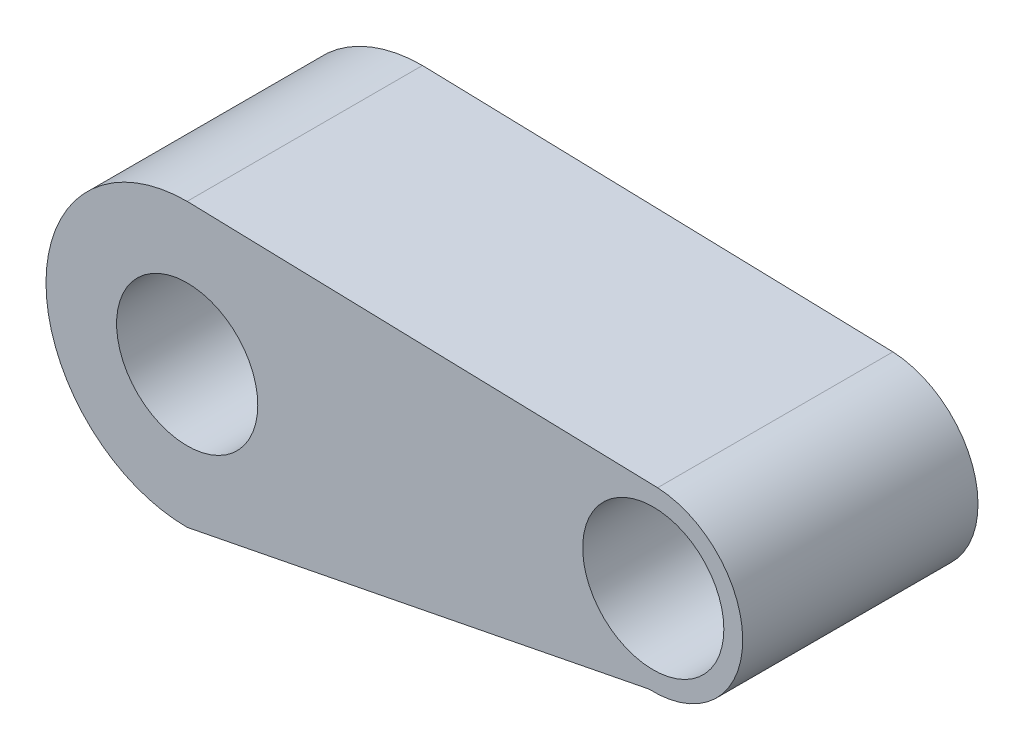
ISO-10303-21;
HEADER;
FILE_DESCRIPTION(('STEP AP214'),'2;1');
FILE_NAME('part.step','',(''),(''),'','','');
FILE_SCHEMA(('AUTOMOTIVE_DESIGN { 1 0 10303 214 1 1 1 1 }'));
ENDSEC;
DATA;
#1=APPLICATION_CONTEXT('core data for automotive mechanical design processes');
#2=APPLICATION_PROTOCOL_DEFINITION('international standard','automotive_design',2000,#1);
#3=PRODUCT_CONTEXT('',#1,'mechanical');
#4=PRODUCT('Part','Part','',(#3));
#5=PRODUCT_RELATED_PRODUCT_CATEGORY('part','',(#4));
#6=PRODUCT_DEFINITION_FORMATION('','',#4);
#7=PRODUCT_DEFINITION_CONTEXT('part definition',#1,'design');
#8=PRODUCT_DEFINITION('design','',#6,#7);
#9=PRODUCT_DEFINITION_SHAPE('','',#8);
#10=(LENGTH_UNIT() NAMED_UNIT(*) SI_UNIT(.MILLI.,.METRE.));
#11=(NAMED_UNIT(*) PLANE_ANGLE_UNIT() SI_UNIT($,.RADIAN.));
#12=(NAMED_UNIT(*) SI_UNIT($,.STERADIAN.) SOLID_ANGLE_UNIT());
#13=UNCERTAINTY_MEASURE_WITH_UNIT(LENGTH_MEASURE(1.E-05),#10,'distance_accuracy_value','');
#14=(GEOMETRIC_REPRESENTATION_CONTEXT(3) GLOBAL_UNCERTAINTY_ASSIGNED_CONTEXT((#13)) GLOBAL_UNIT_ASSIGNED_CONTEXT((#10,
#11,#12)) REPRESENTATION_CONTEXT('',''));
#15=CARTESIAN_POINT('',(0.,0.,0.));
#16=DIRECTION('',(0.,0.,1.));
#17=DIRECTION('',(1.,0.,0.));
#18=AXIS2_PLACEMENT_3D('',#15,#16,#17);
#19=CARTESIAN_POINT('',(0.081698830084824,2.99777344787614,5.));
#20=DIRECTION('',(0.0272430549184135,0.999628839099149,0.));
#21=DIRECTION('',(-0.999628839099149,0.0272430549184135,0.));
#22=AXIS2_PLACEMENT_3D('',#19,#20,#21);
#23=PLANE('',#22);
#24=DIRECTION('',(0.999628839099149,-0.0272430549184135,0.));
#25=VECTOR('',#24,1.);
#26=CARTESIAN_POINT('',(0.081698830084824,2.99777344787614,0.));
#27=LINE('',#26,#25);
#28=CARTESIAN_POINT('',(0.,3.,0.));
#29=VERTEX_POINT('',#28);
#30=CARTESIAN_POINT('',(9.99628839099149,2.72756945081587,0.));
#31=VERTEX_POINT('',#30);
#32=EDGE_CURVE('E114',#29,#31,#27,.T.);
#33=ORIENTED_EDGE('',*,*,#32,.F.);
#34=DIRECTION('',(0.,0.,-1.));
#35=VECTOR('',#34,1.);
#36=CARTESIAN_POINT('',(0.,3.,5.));
#37=LINE('',#36,#35);
#38=CARTESIAN_POINT('',(0.,3.,5.));
#39=VERTEX_POINT('',#38);
#40=EDGE_CURVE('E11',#39,#29,#37,.T.);
#41=ORIENTED_EDGE('',*,*,#40,.F.);
#42=DIRECTION('',(0.999628839099149,-0.0272430549184135,0.));
#43=VECTOR('',#42,1.);
#44=CARTESIAN_POINT('',(0.081698830084824,2.99777344787614,5.));
#45=LINE('',#44,#43);
#46=CARTESIAN_POINT('',(9.99628839099149,2.72756945081587,5.));
#47=VERTEX_POINT('',#46);
#48=EDGE_CURVE('E94',#39,#47,#45,.T.);
#49=ORIENTED_EDGE('',*,*,#48,.T.);
#50=DIRECTION('',(0.,0.,-1.));
#51=VECTOR('',#50,1.);
#52=CARTESIAN_POINT('',(9.99628839099149,2.72756945081587,5.));
#53=LINE('',#52,#51);
#54=EDGE_CURVE('E55',#47,#31,#53,.T.);
#55=ORIENTED_EDGE('',*,*,#54,.T.);
#56=EDGE_LOOP('',(#33,#41,#49,#55));
#57=FACE_BOUND('',#56,.T.);
#58=ADVANCED_FACE('F38',(#57),#23,.T.);
#59=CARTESIAN_POINT('',(0.,0.,5.));
#60=DIRECTION('',(0.,0.,-1.));
#61=DIRECTION('',(-1.,0.,0.));
#62=AXIS2_PLACEMENT_3D('',#59,#60,#61);
#63=CYLINDRICAL_SURFACE('',#62,3.);
#64=CARTESIAN_POINT('',(0.,0.,0.));
#65=DIRECTION('',(0.,0.,1.));
#66=DIRECTION('',(1.,0.,0.));
#67=AXIS2_PLACEMENT_3D('',#64,#65,#66);
#68=CIRCLE('',#67,3.);
#69=CARTESIAN_POINT('',(0.,-3.,0.));
#70=VERTEX_POINT('',#69);
#71=EDGE_CURVE('E99',#29,#70,#68,.T.);
#72=ORIENTED_EDGE('',*,*,#71,.T.);
#73=DIRECTION('',(0.,0.,-1.));
#74=VECTOR('',#73,1.);
#75=CARTESIAN_POINT('',(0.,-3.,5.));
#76=LINE('',#75,#74);
#77=CARTESIAN_POINT('',(0.,-3.,5.));
#78=VERTEX_POINT('',#77);
#79=EDGE_CURVE('E47',#78,#70,#76,.T.);
#80=ORIENTED_EDGE('',*,*,#79,.F.);
#81=CARTESIAN_POINT('',(0.,0.,5.));
#82=DIRECTION('',(0.,0.,1.));
#83=DIRECTION('',(1.,0.,0.));
#84=AXIS2_PLACEMENT_3D('',#81,#82,#83);
#85=CIRCLE('',#84,3.);
#86=EDGE_CURVE('E89',#39,#78,#85,.T.);
#87=ORIENTED_EDGE('',*,*,#86,.F.);
#88=ORIENTED_EDGE('',*,*,#40,.T.);
#89=EDGE_LOOP('',(#72,#80,#87,#88));
#90=FACE_BOUND('',#89,.T.);
#91=ADVANCED_FACE('F97',(#90),#63,.T.);
#92=CARTESIAN_POINT('',(0.568175937904269,-2.8882276843467,5.));
#93=DIRECTION('',(-0.193021860293335,0.981194456491118,0.));
#94=DIRECTION('',(-0.981194456491118,-0.193021860293335,0.));
#95=AXIS2_PLACEMENT_3D('',#92,#93,#94);
#96=PLANE('',#95);
#97=DIRECTION('',(0.981194456491118,0.193021860293335,0.));
#98=VECTOR('',#97,1.);
#99=CARTESIAN_POINT('',(0.568175937904269,-2.8882276843467,0.));
#100=LINE('',#99,#98);
#101=CARTESIAN_POINT('',(9.81194456491118,-1.06978139706666,0.));
#102=VERTEX_POINT('',#101);
#103=EDGE_CURVE('E111',#70,#102,#100,.T.);
#104=ORIENTED_EDGE('',*,*,#103,.T.);
#105=DIRECTION('',(0.,0.,-1.));
#106=VECTOR('',#105,1.);
#107=CARTESIAN_POINT('',(9.81194456491118,-1.06978139706666,5.));
#108=LINE('',#107,#106);
#109=CARTESIAN_POINT('',(9.81194456491118,-1.06978139706666,5.));
#110=VERTEX_POINT('',#109);
#111=EDGE_CURVE('E69',#110,#102,#108,.T.);
#112=ORIENTED_EDGE('',*,*,#111,.F.);
#113=DIRECTION('',(0.981194456491118,0.193021860293335,0.));
#114=VECTOR('',#113,1.);
#115=CARTESIAN_POINT('',(0.568175937904269,-2.8882276843467,5.));
#116=LINE('',#115,#114);
#117=EDGE_CURVE('E81',#78,#110,#116,.T.);
#118=ORIENTED_EDGE('',*,*,#117,.F.);
#119=ORIENTED_EDGE('',*,*,#79,.T.);
#120=EDGE_LOOP('',(#104,#112,#118,#119));
#121=FACE_BOUND('',#120,.T.);
#122=ADVANCED_FACE('F83',(#121),#96,.F.);
#123=CARTESIAN_POINT('',(9.90411647795134,0.828894026874606,5.));
#124=DIRECTION('',(0.,0.,-1.));
#125=DIRECTION('',(-1.,0.,0.));
#126=AXIS2_PLACEMENT_3D('',#123,#124,#125);
#127=CYLINDRICAL_SURFACE('',#126,1.90091136748456);
#128=CARTESIAN_POINT('',(9.90411647795134,0.828894026874606,0.));
#129=DIRECTION('',(0.,0.,1.));
#130=DIRECTION('',(1.,0.,0.));
#131=AXIS2_PLACEMENT_3D('',#128,#129,#130);
#132=CIRCLE('',#131,1.90091136748456);
#133=EDGE_CURVE('E108',#31,#102,#132,.F.);
#134=ORIENTED_EDGE('',*,*,#133,.F.);
#135=ORIENTED_EDGE('',*,*,#54,.F.);
#136=CARTESIAN_POINT('',(9.90411647795134,0.828894026874606,5.));
#137=DIRECTION('',(0.,0.,1.));
#138=DIRECTION('',(1.,0.,0.));
#139=AXIS2_PLACEMENT_3D('',#136,#137,#138);
#140=CIRCLE('',#139,1.90091136748456);
#141=EDGE_CURVE('E88',#47,#110,#140,.F.);
#142=ORIENTED_EDGE('',*,*,#141,.T.);
#143=ORIENTED_EDGE('',*,*,#111,.T.);
#144=EDGE_LOOP('',(#134,#135,#142,#143));
#145=FACE_BOUND('',#144,.T.);
#146=ADVANCED_FACE('F148',(#145),#127,.T.);
#147=CARTESIAN_POINT('',(0.,0.,5.));
#148=DIRECTION('',(0.,0.,-1.));
#149=DIRECTION('',(-1.,0.,0.));
#150=AXIS2_PLACEMENT_3D('',#147,#148,#149);
#151=CYLINDRICAL_SURFACE('',#150,1.5);
#152=CARTESIAN_POINT('',(0.,0.,5.));
#153=DIRECTION('',(0.,0.,1.));
#154=DIRECTION('',(1.,0.,0.));
#155=AXIS2_PLACEMENT_3D('',#152,#153,#154);
#156=CIRCLE('',#155,1.5);
#157=CARTESIAN_POINT('',(1.5,0.,5.));
#158=VERTEX_POINT('',#157);
#159=EDGE_CURVE('E107',#158,#158,#156,.T.);
#160=ORIENTED_EDGE('',*,*,#159,.T.);
#161=EDGE_LOOP('',(#160));
#162=FACE_BOUND('',#161,.T.);
#163=CARTESIAN_POINT('',(0.,0.,0.));
#164=DIRECTION('',(0.,0.,1.));
#165=DIRECTION('',(1.,0.,0.));
#166=AXIS2_PLACEMENT_3D('',#163,#164,#165);
#167=CIRCLE('',#166,1.5);
#168=CARTESIAN_POINT('',(1.5,0.,0.));
#169=VERTEX_POINT('',#168);
#170=EDGE_CURVE('E116',#169,#169,#167,.T.);
#171=ORIENTED_EDGE('',*,*,#170,.F.);
#172=EDGE_LOOP('',(#171));
#173=FACE_BOUND('',#172,.T.);
#174=ADVANCED_FACE('F40',(#162,#173),#151,.F.);
#175=CARTESIAN_POINT('',(9.90411647795134,0.828894026874606,5.));
#176=DIRECTION('',(0.,0.,-1.));
#177=DIRECTION('',(-1.,0.,0.));
#178=AXIS2_PLACEMENT_3D('',#175,#176,#177);
#179=CYLINDRICAL_SURFACE('',#178,1.5);
#180=CARTESIAN_POINT('',(9.90411647795134,0.828894026874606,5.));
#181=DIRECTION('',(0.,0.,1.));
#182=DIRECTION('',(1.,0.,0.));
#183=AXIS2_PLACEMENT_3D('',#180,#181,#182);
#184=CIRCLE('',#183,1.5);
#185=CARTESIAN_POINT('',(11.4041164779513,0.828894026874606,5.));
#186=VERTEX_POINT('',#185);
#187=EDGE_CURVE('E103',#186,#186,#184,.T.);
#188=ORIENTED_EDGE('',*,*,#187,.T.);
#189=EDGE_LOOP('',(#188));
#190=FACE_BOUND('',#189,.T.);
#191=CARTESIAN_POINT('',(9.90411647795134,0.828894026874606,0.));
#192=DIRECTION('',(0.,0.,1.));
#193=DIRECTION('',(1.,0.,0.));
#194=AXIS2_PLACEMENT_3D('',#191,#192,#193);
#195=CIRCLE('',#194,1.5);
#196=CARTESIAN_POINT('',(11.4041164779513,0.828894026874606,0.));
#197=VERTEX_POINT('',#196);
#198=EDGE_CURVE('E104',#197,#197,#195,.T.);
#199=ORIENTED_EDGE('',*,*,#198,.F.);
#200=EDGE_LOOP('',(#199));
#201=FACE_BOUND('',#200,.T.);
#202=ADVANCED_FACE('F130',(#190,#201),#179,.F.);
#203=CARTESIAN_POINT('',(0.,0.,5.));
#204=DIRECTION('',(0.,0.,1.));
#205=DIRECTION('',(1.,0.,0.));
#206=AXIS2_PLACEMENT_3D('',#203,#204,#205);
#207=PLANE('',#206);
#208=ORIENTED_EDGE('',*,*,#159,.F.);
#209=EDGE_LOOP('',(#208));
#210=FACE_BOUND('',#209,.T.);
#211=ORIENTED_EDGE('',*,*,#48,.F.);
#212=ORIENTED_EDGE('',*,*,#86,.T.);
#213=ORIENTED_EDGE('',*,*,#117,.T.);
#214=ORIENTED_EDGE('',*,*,#141,.F.);
#215=EDGE_LOOP('',(#211,#212,#213,#214));
#216=FACE_BOUND('',#215,.T.);
#217=ORIENTED_EDGE('',*,*,#187,.F.);
#218=EDGE_LOOP('',(#217));
#219=FACE_BOUND('',#218,.T.);
#220=ADVANCED_FACE('F92',(#210,#216,#219),#207,.T.);
#221=CARTESIAN_POINT('',(0.,0.,0.));
#222=DIRECTION('',(0.,0.,1.));
#223=DIRECTION('',(1.,0.,0.));
#224=AXIS2_PLACEMENT_3D('',#221,#222,#223);
#225=PLANE('',#224);
#226=ORIENTED_EDGE('',*,*,#170,.T.);
#227=EDGE_LOOP('',(#226));
#228=FACE_BOUND('',#227,.T.);
#229=ORIENTED_EDGE('',*,*,#32,.T.);
#230=ORIENTED_EDGE('',*,*,#133,.T.);
#231=ORIENTED_EDGE('',*,*,#103,.F.);
#232=ORIENTED_EDGE('',*,*,#71,.F.);
#233=EDGE_LOOP('',(#229,#230,#231,#232));
#234=FACE_BOUND('',#233,.T.);
#235=ORIENTED_EDGE('',*,*,#198,.T.);
#236=EDGE_LOOP('',(#235));
#237=FACE_BOUND('',#236,.T.);
#238=ADVANCED_FACE('F129',(#228,#234,#237),#225,.F.);
#239=CLOSED_SHELL('',(#58,#91,#122,#146,#174,#202,#220,#238));
#240=MANIFOLD_SOLID_BREP('B2',#239);
#241=ADVANCED_BREP_SHAPE_REPRESENTATION('',(#18,#240),#14);
#242=SHAPE_DEFINITION_REPRESENTATION(#9,#241);
ENDSEC;
END-ISO-10303-21;
